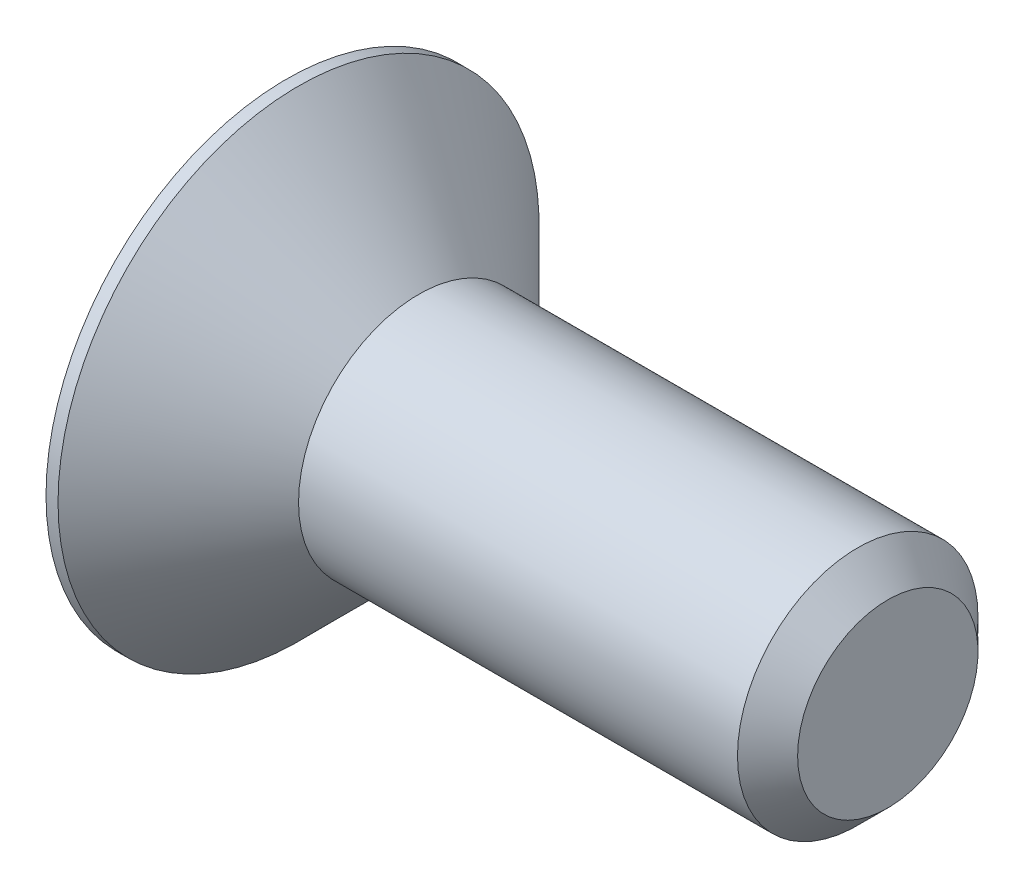
ISO-10303-21;
HEADER;
FILE_DESCRIPTION(('STEP AP214'),'2;1');
FILE_NAME('part.step','',(''),(''),'','','');
FILE_SCHEMA(('AUTOMOTIVE_DESIGN { 1 0 10303 214 1 1 1 1 }'));
ENDSEC;
DATA;
#1=APPLICATION_CONTEXT('core data for automotive mechanical design processes');
#2=APPLICATION_PROTOCOL_DEFINITION('international standard','automotive_design',2000,#1);
#3=PRODUCT_CONTEXT('',#1,'mechanical');
#4=PRODUCT('Part','Part','',(#3));
#5=PRODUCT_RELATED_PRODUCT_CATEGORY('part','',(#4));
#6=PRODUCT_DEFINITION_FORMATION('','',#4);
#7=PRODUCT_DEFINITION_CONTEXT('part definition',#1,'design');
#8=PRODUCT_DEFINITION('design','',#6,#7);
#9=PRODUCT_DEFINITION_SHAPE('','',#8);
#10=(LENGTH_UNIT() NAMED_UNIT(*) SI_UNIT(.MILLI.,.METRE.));
#11=(NAMED_UNIT(*) PLANE_ANGLE_UNIT() SI_UNIT($,.RADIAN.));
#12=(NAMED_UNIT(*) SI_UNIT($,.STERADIAN.) SOLID_ANGLE_UNIT());
#13=UNCERTAINTY_MEASURE_WITH_UNIT(LENGTH_MEASURE(1.E-05),#10,'distance_accuracy_value','');
#14=(GEOMETRIC_REPRESENTATION_CONTEXT(3) GLOBAL_UNCERTAINTY_ASSIGNED_CONTEXT((#13)) GLOBAL_UNIT_ASSIGNED_CONTEXT((#10,
#11,#12)) REPRESENTATION_CONTEXT('',''));
#15=CARTESIAN_POINT('',(0.,0.,0.));
#16=DIRECTION('',(0.,0.,1.));
#17=DIRECTION('',(1.,0.,0.));
#18=AXIS2_PLACEMENT_3D('',#15,#16,#17);
#19=CARTESIAN_POINT('',(0.,0.,0.));
#20=DIRECTION('',(1.,0.,0.));
#21=DIRECTION('',(0.,0.,-1.));
#22=AXIS2_PLACEMENT_3D('',#19,#20,#21);
#23=PLANE('',#22);
#24=DIRECTION('',(0.,0.866025403784439,0.5));
#25=VECTOR('',#24,1.);
#26=CARTESIAN_POINT('',(0.,-0.75,0.433012701892219));
#27=LINE('',#26,#25);
#28=CARTESIAN_POINT('',(0.,-0.75,0.433012701892219));
#29=VERTEX_POINT('',#28);
#30=CARTESIAN_POINT('',(0.,0.,0.866025403784438));
#31=VERTEX_POINT('',#30);
#32=EDGE_CURVE('E121',#29,#31,#27,.T.);
#33=ORIENTED_EDGE('',*,*,#32,.F.);
#34=DIRECTION('',(0.,0.,1.));
#35=VECTOR('',#34,1.);
#36=CARTESIAN_POINT('',(0.,-0.75,-0.43301270189222));
#37=LINE('',#36,#35);
#38=CARTESIAN_POINT('',(0.,-0.75,-0.43301270189222));
#39=VERTEX_POINT('',#38);
#40=EDGE_CURVE('E47',#39,#29,#37,.T.);
#41=ORIENTED_EDGE('',*,*,#40,.F.);
#42=DIRECTION('',(0.,-0.866025403784439,0.5));
#43=VECTOR('',#42,1.);
#44=CARTESIAN_POINT('',(0.,0.,-0.866025403784439));
#45=LINE('',#44,#43);
#46=CARTESIAN_POINT('',(0.,0.,-0.866025403784439));
#47=VERTEX_POINT('',#46);
#48=EDGE_CURVE('E130',#47,#39,#45,.T.);
#49=ORIENTED_EDGE('',*,*,#48,.F.);
#50=DIRECTION('',(0.,-0.866025403784439,-0.5));
#51=VECTOR('',#50,1.);
#52=CARTESIAN_POINT('',(0.,0.75,-0.43301270189222));
#53=LINE('',#52,#51);
#54=CARTESIAN_POINT('',(0.,0.75,-0.43301270189222));
#55=VERTEX_POINT('',#54);
#56=EDGE_CURVE('E128',#55,#47,#53,.T.);
#57=ORIENTED_EDGE('',*,*,#56,.F.);
#58=DIRECTION('',(0.,0.,-1.));
#59=VECTOR('',#58,1.);
#60=CARTESIAN_POINT('',(0.,0.75,0.433012701892219));
#61=LINE('',#60,#59);
#62=CARTESIAN_POINT('',(0.,0.75,0.433012701892219));
#63=VERTEX_POINT('',#62);
#64=EDGE_CURVE('E95',#63,#55,#61,.T.);
#65=ORIENTED_EDGE('',*,*,#64,.F.);
#66=DIRECTION('',(0.,0.866025403784439,-0.5));
#67=VECTOR('',#66,1.);
#68=CARTESIAN_POINT('',(0.,0.,0.866025403784438));
#69=LINE('',#68,#67);
#70=EDGE_CURVE('E124',#31,#63,#69,.T.);
#71=ORIENTED_EDGE('',*,*,#70,.F.);
#72=EDGE_LOOP('',(#33,#41,#49,#57,#65,#71));
#73=FACE_BOUND('',#72,.T.);
#74=CARTESIAN_POINT('',(0.,0.,0.));
#75=DIRECTION('',(-1.,0.,0.));
#76=DIRECTION('',(0.,0.,1.));
#77=AXIS2_PLACEMENT_3D('',#74,#75,#76);
#78=CIRCLE('',#77,2.);
#79=CARTESIAN_POINT('',(0.,0.,2.));
#80=VERTEX_POINT('',#79);
#81=EDGE_CURVE('E11',#80,#80,#78,.T.);
#82=ORIENTED_EDGE('',*,*,#81,.T.);
#83=EDGE_LOOP('',(#82));
#84=FACE_BOUND('',#83,.T.);
#85=ADVANCED_FACE('F33',(#73,#84),#23,.F.);
#86=CARTESIAN_POINT('',(-2.28184155946539,0.,0.));
#87=DIRECTION('',(-1.,0.,0.));
#88=DIRECTION('',(0.,0.,1.));
#89=AXIS2_PLACEMENT_3D('',#86,#87,#88);
#90=CYLINDRICAL_SURFACE('',#89,2.);
#91=ORIENTED_EDGE('',*,*,#81,.F.);
#92=EDGE_LOOP('',(#91));
#93=FACE_BOUND('',#92,.T.);
#94=CARTESIAN_POINT('',(0.0999999999999998,0.,0.));
#95=DIRECTION('',(-1.,0.,0.));
#96=DIRECTION('',(0.,0.,1.));
#97=AXIS2_PLACEMENT_3D('',#94,#95,#96);
#98=CIRCLE('',#97,2.);
#99=CARTESIAN_POINT('',(0.0999999999999998,0.,2.));
#100=VERTEX_POINT('',#99);
#101=EDGE_CURVE('E40',#100,#100,#98,.T.);
#102=ORIENTED_EDGE('',*,*,#101,.T.);
#103=EDGE_LOOP('',(#102));
#104=FACE_BOUND('',#103,.T.);
#105=ADVANCED_FACE('F150',(#93,#104),#90,.T.);
#106=CARTESIAN_POINT('',(1.1,0.,0.));
#107=DIRECTION('',(-1.,0.,0.));
#108=DIRECTION('',(0.,0.,1.));
#109=AXIS2_PLACEMENT_3D('',#106,#107,#108);
#110=CONICAL_SURFACE('',#109,1.,0.78539816339745);
#111=ORIENTED_EDGE('',*,*,#101,.F.);
#112=EDGE_LOOP('',(#111));
#113=FACE_BOUND('',#112,.T.);
#114=CARTESIAN_POINT('',(1.1,0.,0.));
#115=DIRECTION('',(-1.,0.,0.));
#116=DIRECTION('',(0.,0.,1.));
#117=AXIS2_PLACEMENT_3D('',#114,#115,#116);
#118=CIRCLE('',#117,1.);
#119=CARTESIAN_POINT('',(1.1,0.,1.));
#120=VERTEX_POINT('',#119);
#121=EDGE_CURVE('E145',#120,#120,#118,.T.);
#122=ORIENTED_EDGE('',*,*,#121,.T.);
#123=EDGE_LOOP('',(#122));
#124=FACE_BOUND('',#123,.T.);
#125=ADVANCED_FACE('F152',(#113,#124),#110,.T.);
#126=CARTESIAN_POINT('',(-2.28184155946539,0.,0.));
#127=DIRECTION('',(-1.,0.,0.));
#128=DIRECTION('',(0.,0.,1.));
#129=AXIS2_PLACEMENT_3D('',#126,#127,#128);
#130=CYLINDRICAL_SURFACE('',#129,1.);
#131=ORIENTED_EDGE('',*,*,#121,.F.);
#132=EDGE_LOOP('',(#131));
#133=FACE_BOUND('',#132,.T.);
#134=CARTESIAN_POINT('',(4.75,0.,0.));
#135=DIRECTION('',(-1.,0.,0.));
#136=DIRECTION('',(0.,0.,1.));
#137=AXIS2_PLACEMENT_3D('',#134,#135,#136);
#138=CIRCLE('',#137,1.);
#139=CARTESIAN_POINT('',(4.75,0.,1.));
#140=VERTEX_POINT('',#139);
#141=EDGE_CURVE('E142',#140,#140,#138,.T.);
#142=ORIENTED_EDGE('',*,*,#141,.T.);
#143=EDGE_LOOP('',(#142));
#144=FACE_BOUND('',#143,.T.);
#145=ADVANCED_FACE('F155',(#133,#144),#130,.T.);
#146=CARTESIAN_POINT('',(5.,0.,0.));
#147=DIRECTION('',(-1.,0.,0.));
#148=DIRECTION('',(0.,0.,1.));
#149=AXIS2_PLACEMENT_3D('',#146,#147,#148);
#150=CONICAL_SURFACE('',#149,0.75,0.78539816339745);
#151=ORIENTED_EDGE('',*,*,#141,.F.);
#152=EDGE_LOOP('',(#151));
#153=FACE_BOUND('',#152,.T.);
#154=CARTESIAN_POINT('',(5.,0.,0.));
#155=DIRECTION('',(-1.,0.,0.));
#156=DIRECTION('',(0.,0.,1.));
#157=AXIS2_PLACEMENT_3D('',#154,#155,#156);
#158=CIRCLE('',#157,0.75);
#159=CARTESIAN_POINT('',(5.,0.,0.75));
#160=VERTEX_POINT('',#159);
#161=EDGE_CURVE('E134',#160,#160,#158,.T.);
#162=ORIENTED_EDGE('',*,*,#161,.T.);
#163=EDGE_LOOP('',(#162));
#164=FACE_BOUND('',#163,.T.);
#165=ADVANCED_FACE('F161',(#153,#164),#150,.T.);
#166=CARTESIAN_POINT('',(5.,0.75,0.));
#167=DIRECTION('',(-1.,0.,0.));
#168=DIRECTION('',(0.,0.,1.));
#169=AXIS2_PLACEMENT_3D('',#166,#167,#168);
#170=PLANE('',#169);
#171=ORIENTED_EDGE('',*,*,#161,.F.);
#172=EDGE_LOOP('',(#171));
#173=FACE_BOUND('',#172,.T.);
#174=ADVANCED_FACE('F167',(#173),#170,.F.);
#175=CARTESIAN_POINT('',(0.8,-0.75,-0.43301270189222));
#176=DIRECTION('',(0.,-1.,0.));
#177=DIRECTION('',(0.,0.,-1.));
#178=AXIS2_PLACEMENT_3D('',#175,#176,#177);
#179=PLANE('',#178);
#180=ORIENTED_EDGE('',*,*,#40,.T.);
#181=DIRECTION('',(-1.,0.,0.));
#182=VECTOR('',#181,1.);
#183=CARTESIAN_POINT('',(0.8,-0.75,0.433012701892219));
#184=LINE('',#183,#182);
#185=CARTESIAN_POINT('',(0.8,-0.75,0.433012701892219));
#186=VERTEX_POINT('',#185);
#187=EDGE_CURVE('E77',#186,#29,#184,.T.);
#188=ORIENTED_EDGE('',*,*,#187,.F.);
#189=DIRECTION('',(0.,0.,1.));
#190=VECTOR('',#189,1.);
#191=CARTESIAN_POINT('',(0.8,-0.75,-0.43301270189222));
#192=LINE('',#191,#190);
#193=CARTESIAN_POINT('',(0.8,-0.75,-0.43301270189222));
#194=VERTEX_POINT('',#193);
#195=EDGE_CURVE('E132',#194,#186,#192,.T.);
#196=ORIENTED_EDGE('',*,*,#195,.F.);
#197=DIRECTION('',(-1.,0.,0.));
#198=VECTOR('',#197,1.);
#199=CARTESIAN_POINT('',(0.8,-0.75,-0.43301270189222));
#200=LINE('',#199,#198);
#201=EDGE_CURVE('E55',#194,#39,#200,.T.);
#202=ORIENTED_EDGE('',*,*,#201,.T.);
#203=EDGE_LOOP('',(#180,#188,#196,#202));
#204=FACE_BOUND('',#203,.T.);
#205=ADVANCED_FACE('F172',(#204),#179,.F.);
#206=CARTESIAN_POINT('',(0.8,0.,-0.866025403784439));
#207=DIRECTION('',(0.,-0.5,-0.866025403784439));
#208=DIRECTION('',(0.,0.866025403784439,-0.5));
#209=AXIS2_PLACEMENT_3D('',#206,#207,#208);
#210=PLANE('',#209);
#211=ORIENTED_EDGE('',*,*,#48,.T.);
#212=ORIENTED_EDGE('',*,*,#201,.F.);
#213=DIRECTION('',(0.,-0.866025403784439,0.5));
#214=VECTOR('',#213,1.);
#215=CARTESIAN_POINT('',(0.8,0.,-0.866025403784439));
#216=LINE('',#215,#214);
#217=CARTESIAN_POINT('',(0.8,0.,-0.866025403784439));
#218=VERTEX_POINT('',#217);
#219=EDGE_CURVE('E107',#218,#194,#216,.T.);
#220=ORIENTED_EDGE('',*,*,#219,.F.);
#221=DIRECTION('',(-1.,0.,0.));
#222=VECTOR('',#221,1.);
#223=CARTESIAN_POINT('',(0.8,0.,-0.866025403784439));
#224=LINE('',#223,#222);
#225=EDGE_CURVE('E99',#218,#47,#224,.T.);
#226=ORIENTED_EDGE('',*,*,#225,.T.);
#227=EDGE_LOOP('',(#211,#212,#220,#226));
#228=FACE_BOUND('',#227,.T.);
#229=ADVANCED_FACE('F177',(#228),#210,.F.);
#230=CARTESIAN_POINT('',(0.8,0.75,-0.43301270189222));
#231=DIRECTION('',(0.,0.5,-0.866025403784439));
#232=DIRECTION('',(0.,0.866025403784439,0.5));
#233=AXIS2_PLACEMENT_3D('',#230,#231,#232);
#234=PLANE('',#233);
#235=ORIENTED_EDGE('',*,*,#56,.T.);
#236=ORIENTED_EDGE('',*,*,#225,.F.);
#237=DIRECTION('',(0.,-0.866025403784439,-0.5));
#238=VECTOR('',#237,1.);
#239=CARTESIAN_POINT('',(0.8,0.75,-0.43301270189222));
#240=LINE('',#239,#238);
#241=CARTESIAN_POINT('',(0.8,0.75,-0.43301270189222));
#242=VERTEX_POINT('',#241);
#243=EDGE_CURVE('E103',#242,#218,#240,.T.);
#244=ORIENTED_EDGE('',*,*,#243,.F.);
#245=DIRECTION('',(-1.,0.,0.));
#246=VECTOR('',#245,1.);
#247=CARTESIAN_POINT('',(0.8,0.75,-0.43301270189222));
#248=LINE('',#247,#246);
#249=EDGE_CURVE('E88',#242,#55,#248,.T.);
#250=ORIENTED_EDGE('',*,*,#249,.T.);
#251=EDGE_LOOP('',(#235,#236,#244,#250));
#252=FACE_BOUND('',#251,.T.);
#253=ADVANCED_FACE('F104',(#252),#234,.F.);
#254=CARTESIAN_POINT('',(0.8,0.75,0.433012701892219));
#255=DIRECTION('',(0.,1.,0.));
#256=DIRECTION('',(0.,0.,1.));
#257=AXIS2_PLACEMENT_3D('',#254,#255,#256);
#258=PLANE('',#257);
#259=ORIENTED_EDGE('',*,*,#64,.T.);
#260=ORIENTED_EDGE('',*,*,#249,.F.);
#261=DIRECTION('',(0.,0.,-1.));
#262=VECTOR('',#261,1.);
#263=CARTESIAN_POINT('',(0.8,0.75,0.433012701892219));
#264=LINE('',#263,#262);
#265=CARTESIAN_POINT('',(0.8,0.75,0.433012701892219));
#266=VERTEX_POINT('',#265);
#267=EDGE_CURVE('E92',#266,#242,#264,.T.);
#268=ORIENTED_EDGE('',*,*,#267,.F.);
#269=DIRECTION('',(-1.,0.,0.));
#270=VECTOR('',#269,1.);
#271=CARTESIAN_POINT('',(0.8,0.75,0.433012701892219));
#272=LINE('',#271,#270);
#273=EDGE_CURVE('E100',#266,#63,#272,.T.);
#274=ORIENTED_EDGE('',*,*,#273,.T.);
#275=EDGE_LOOP('',(#259,#260,#268,#274));
#276=FACE_BOUND('',#275,.T.);
#277=ADVANCED_FACE('F90',(#276),#258,.F.);
#278=CARTESIAN_POINT('',(0.8,0.,0.866025403784438));
#279=DIRECTION('',(0.,0.5,0.866025403784439));
#280=DIRECTION('',(0.,-0.866025403784439,0.5));
#281=AXIS2_PLACEMENT_3D('',#278,#279,#280);
#282=PLANE('',#281);
#283=ORIENTED_EDGE('',*,*,#70,.T.);
#284=ORIENTED_EDGE('',*,*,#273,.F.);
#285=DIRECTION('',(0.,0.866025403784439,-0.5));
#286=VECTOR('',#285,1.);
#287=CARTESIAN_POINT('',(0.8,0.,0.866025403784438));
#288=LINE('',#287,#286);
#289=CARTESIAN_POINT('',(0.8,0.,0.866025403784438));
#290=VERTEX_POINT('',#289);
#291=EDGE_CURVE('E113',#290,#266,#288,.T.);
#292=ORIENTED_EDGE('',*,*,#291,.F.);
#293=DIRECTION('',(-1.,0.,0.));
#294=VECTOR('',#293,1.);
#295=CARTESIAN_POINT('',(0.8,0.,0.866025403784438));
#296=LINE('',#295,#294);
#297=EDGE_CURVE('E137',#290,#31,#296,.T.);
#298=ORIENTED_EDGE('',*,*,#297,.T.);
#299=EDGE_LOOP('',(#283,#284,#292,#298));
#300=FACE_BOUND('',#299,.T.);
#301=ADVANCED_FACE('F203',(#300),#282,.F.);
#302=CARTESIAN_POINT('',(0.8,-0.75,0.433012701892219));
#303=DIRECTION('',(0.,-0.5,0.866025403784439));
#304=DIRECTION('',(0.,-0.866025403784439,-0.5));
#305=AXIS2_PLACEMENT_3D('',#302,#303,#304);
#306=PLANE('',#305);
#307=ORIENTED_EDGE('',*,*,#32,.T.);
#308=ORIENTED_EDGE('',*,*,#297,.F.);
#309=DIRECTION('',(0.,0.866025403784439,0.5));
#310=VECTOR('',#309,1.);
#311=CARTESIAN_POINT('',(0.8,-0.75,0.433012701892219));
#312=LINE('',#311,#310);
#313=EDGE_CURVE('E115',#186,#290,#312,.T.);
#314=ORIENTED_EDGE('',*,*,#313,.F.);
#315=ORIENTED_EDGE('',*,*,#187,.T.);
#316=EDGE_LOOP('',(#307,#308,#314,#315));
#317=FACE_BOUND('',#316,.T.);
#318=ADVANCED_FACE('F191',(#317),#306,.F.);
#319=CARTESIAN_POINT('',(0.8,0.,0.));
#320=DIRECTION('',(-1.,0.,0.));
#321=DIRECTION('',(0.,0.,1.));
#322=AXIS2_PLACEMENT_3D('',#319,#320,#321);
#323=PLANE('',#322);
#324=ORIENTED_EDGE('',*,*,#195,.T.);
#325=ORIENTED_EDGE('',*,*,#313,.T.);
#326=ORIENTED_EDGE('',*,*,#291,.T.);
#327=ORIENTED_EDGE('',*,*,#267,.T.);
#328=ORIENTED_EDGE('',*,*,#243,.T.);
#329=ORIENTED_EDGE('',*,*,#219,.T.);
#330=EDGE_LOOP('',(#324,#325,#326,#327,#328,#329));
#331=FACE_BOUND('',#330,.T.);
#332=ADVANCED_FACE('F110',(#331),#323,.T.);
#333=CLOSED_SHELL('',(#85,#105,#125,#145,#165,#174,#205,#229,#253,#277,#301,#318,#332));
#334=MANIFOLD_SOLID_BREP('B2',#333);
#335=ADVANCED_BREP_SHAPE_REPRESENTATION('',(#18,#334),#14);
#336=SHAPE_DEFINITION_REPRESENTATION(#9,#335);
ENDSEC;
END-ISO-10303-21;
